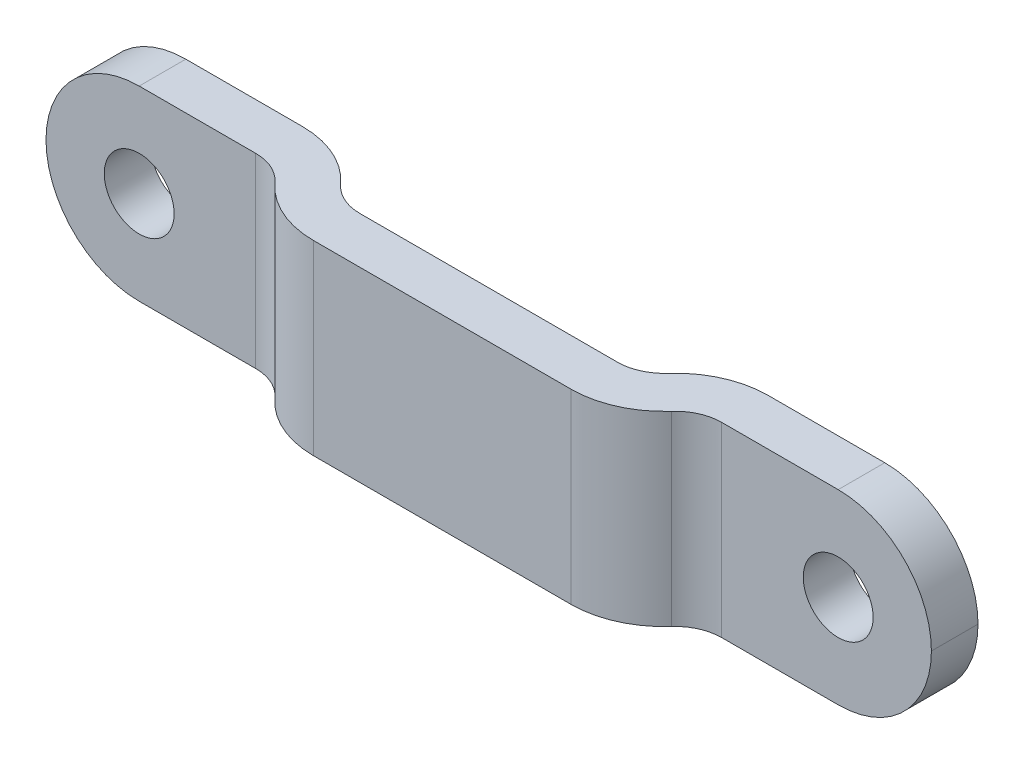
ISO-10303-21;
HEADER;
FILE_DESCRIPTION(('STEP AP214'),'2;1');
FILE_NAME('part.step','',(''),(''),'','','');
FILE_SCHEMA(('AUTOMOTIVE_DESIGN { 1 0 10303 214 1 1 1 1 }'));
ENDSEC;
DATA;
#1=APPLICATION_CONTEXT('core data for automotive mechanical design processes');
#2=APPLICATION_PROTOCOL_DEFINITION('international standard','automotive_design',2000,#1);
#3=PRODUCT_CONTEXT('',#1,'mechanical');
#4=PRODUCT('Part','Part','',(#3));
#5=PRODUCT_RELATED_PRODUCT_CATEGORY('part','',(#4));
#6=PRODUCT_DEFINITION_FORMATION('','',#4);
#7=PRODUCT_DEFINITION_CONTEXT('part definition',#1,'design');
#8=PRODUCT_DEFINITION('design','',#6,#7);
#9=PRODUCT_DEFINITION_SHAPE('','',#8);
#10=(LENGTH_UNIT() NAMED_UNIT(*) SI_UNIT(.MILLI.,.METRE.));
#11=(NAMED_UNIT(*) PLANE_ANGLE_UNIT() SI_UNIT($,.RADIAN.));
#12=(NAMED_UNIT(*) SI_UNIT($,.STERADIAN.) SOLID_ANGLE_UNIT());
#13=UNCERTAINTY_MEASURE_WITH_UNIT(LENGTH_MEASURE(1.E-05),#10,'distance_accuracy_value','');
#14=(GEOMETRIC_REPRESENTATION_CONTEXT(3) GLOBAL_UNCERTAINTY_ASSIGNED_CONTEXT((#13)) GLOBAL_UNIT_ASSIGNED_CONTEXT((#10,
#11,#12)) REPRESENTATION_CONTEXT('',''));
#15=CARTESIAN_POINT('',(0.,0.,0.));
#16=DIRECTION('',(0.,0.,1.));
#17=DIRECTION('',(1.,0.,0.));
#18=AXIS2_PLACEMENT_3D('',#15,#16,#17);
#19=CARTESIAN_POINT('',(-30.1625,6.35,3.175));
#20=DIRECTION('',(0.,0.,-1.));
#21=DIRECTION('',(-1.,0.,0.));
#22=AXIS2_PLACEMENT_3D('',#19,#20,#21);
#23=PLANE('',#22);
#24=CARTESIAN_POINT('',(-23.8125,0.,3.17500000000001));
#25=DIRECTION('',(0.,0.,1.));
#26=DIRECTION('',(1.,0.,0.));
#27=AXIS2_PLACEMENT_3D('',#24,#25,#26);
#28=CIRCLE('',#27,2.38125);
#29=CARTESIAN_POINT('',(-21.43125,0.,3.17500000000001));
#30=VERTEX_POINT('',#29);
#31=EDGE_CURVE('E320',#30,#30,#28,.T.);
#32=ORIENTED_EDGE('',*,*,#31,.F.);
#33=EDGE_LOOP('',(#32));
#34=FACE_BOUND('',#33,.T.);
#35=DIRECTION('',(1.,0.,0.));
#36=VECTOR('',#35,1.);
#37=CARTESIAN_POINT('',(-30.1625,6.35,3.175));
#38=LINE('',#37,#36);
#39=CARTESIAN_POINT('',(-23.8125,6.35,3.175));
#40=VERTEX_POINT('',#39);
#41=CARTESIAN_POINT('',(-15.875,6.35,3.17500000000001));
#42=VERTEX_POINT('',#41);
#43=EDGE_CURVE('E170',#40,#42,#38,.T.);
#44=ORIENTED_EDGE('',*,*,#43,.F.);
#45=CARTESIAN_POINT('',(-23.8125,0.,3.175));
#46=DIRECTION('',(0.,0.,-1.));
#47=DIRECTION('',(-1.,0.,0.));
#48=AXIS2_PLACEMENT_3D('',#45,#46,#47);
#49=CIRCLE('',#48,6.35);
#50=CARTESIAN_POINT('',(-30.1625,0.,3.175));
#51=VERTEX_POINT('',#50);
#52=EDGE_CURVE('E68',#40,#51,#49,.F.);
#53=ORIENTED_EDGE('',*,*,#52,.T.);
#54=CARTESIAN_POINT('',(-23.8125,0.,3.175));
#55=DIRECTION('',(0.,0.,-1.));
#56=DIRECTION('',(-1.,0.,0.));
#57=AXIS2_PLACEMENT_3D('',#54,#55,#56);
#58=CIRCLE('',#57,6.35);
#59=CARTESIAN_POINT('',(-23.8125,-6.35,3.175));
#60=VERTEX_POINT('',#59);
#61=EDGE_CURVE('E301',#51,#60,#58,.F.);
#62=ORIENTED_EDGE('',*,*,#61,.T.);
#63=DIRECTION('',(1.,0.,0.));
#64=VECTOR('',#63,1.);
#65=CARTESIAN_POINT('',(-30.1625,-6.35,3.175));
#66=LINE('',#65,#64);
#67=CARTESIAN_POINT('',(-15.875,-6.35,3.17500000000001));
#68=VERTEX_POINT('',#67);
#69=EDGE_CURVE('E185',#60,#68,#66,.T.);
#70=ORIENTED_EDGE('',*,*,#69,.T.);
#71=DIRECTION('',(0.,-1.,0.));
#72=VECTOR('',#71,1.);
#73=CARTESIAN_POINT('',(-15.875,6.35,3.17500000000001));
#74=LINE('',#73,#72);
#75=EDGE_CURVE('E183',#42,#68,#74,.T.);
#76=ORIENTED_EDGE('',*,*,#75,.F.);
#77=EDGE_LOOP('',(#44,#53,#62,#70,#76));
#78=FACE_BOUND('',#77,.T.);
#79=ADVANCED_FACE('F45',(#34,#78),#23,.F.);
#80=CARTESIAN_POINT('',(-15.875,6.35,6.35));
#81=DIRECTION('',(0.,-1.,0.));
#82=DIRECTION('',(0.,0.,-1.));
#83=AXIS2_PLACEMENT_3D('',#80,#81,#82);
#84=CYLINDRICAL_SURFACE('',#83,3.175);
#85=CARTESIAN_POINT('',(-15.875,-6.35,6.35));
#86=DIRECTION('',(0.,-1.,0.));
#87=DIRECTION('',(0.,0.,-1.));
#88=AXIS2_PLACEMENT_3D('',#85,#86,#87);
#89=CIRCLE('',#88,3.175);
#90=CARTESIAN_POINT('',(-13.5084947238127,-6.35,4.23333333333334));
#91=VERTEX_POINT('',#90);
#92=EDGE_CURVE('E228',#68,#91,#89,.T.);
#93=ORIENTED_EDGE('',*,*,#92,.T.);
#94=DIRECTION('',(0.,-1.,0.));
#95=VECTOR('',#94,1.);
#96=CARTESIAN_POINT('',(-13.5084947238127,6.35,4.23333333333334));
#97=LINE('',#96,#95);
#98=CARTESIAN_POINT('',(-13.5084947238127,6.35,4.23333333333334));
#99=VERTEX_POINT('',#98);
#100=EDGE_CURVE('E189',#99,#91,#97,.T.);
#101=ORIENTED_EDGE('',*,*,#100,.F.);
#102=CARTESIAN_POINT('',(-15.875,6.35,6.35));
#103=DIRECTION('',(0.,-1.,0.));
#104=DIRECTION('',(0.,0.,-1.));
#105=AXIS2_PLACEMENT_3D('',#102,#103,#104);
#106=CIRCLE('',#105,3.175);
#107=EDGE_CURVE('E175',#42,#99,#106,.T.);
#108=ORIENTED_EDGE('',*,*,#107,.F.);
#109=ORIENTED_EDGE('',*,*,#75,.T.);
#110=EDGE_LOOP('',(#93,#101,#108,#109));
#111=FACE_BOUND('',#110,.T.);
#112=ADVANCED_FACE('F191',(#111),#84,.F.);
#113=CARTESIAN_POINT('',(-8.77548417143817,6.35,0.));
#114=DIRECTION('',(0.,-1.,0.));
#115=DIRECTION('',(0.,0.,-1.));
#116=AXIS2_PLACEMENT_3D('',#113,#114,#115);
#117=CYLINDRICAL_SURFACE('',#116,6.35);
#118=CARTESIAN_POINT('',(-8.77548417143817,-6.35,0.));
#119=DIRECTION('',(0.,1.,0.));
#120=DIRECTION('',(0.,0.,1.));
#121=AXIS2_PLACEMENT_3D('',#118,#119,#120);
#122=CIRCLE('',#121,6.35);
#123=CARTESIAN_POINT('',(-8.77548417143817,-6.35,6.35));
#124=VERTEX_POINT('',#123);
#125=EDGE_CURVE('E231',#91,#124,#122,.T.);
#126=ORIENTED_EDGE('',*,*,#125,.T.);
#127=DIRECTION('',(0.,-1.,0.));
#128=VECTOR('',#127,1.);
#129=CARTESIAN_POINT('',(-8.77548417143817,6.35,6.35));
#130=LINE('',#129,#128);
#131=CARTESIAN_POINT('',(-8.77548417143817,6.35,6.35));
#132=VERTEX_POINT('',#131);
#133=EDGE_CURVE('E282',#132,#124,#130,.T.);
#134=ORIENTED_EDGE('',*,*,#133,.F.);
#135=CARTESIAN_POINT('',(-8.77548417143817,6.35,0.));
#136=DIRECTION('',(0.,1.,0.));
#137=DIRECTION('',(0.,0.,1.));
#138=AXIS2_PLACEMENT_3D('',#135,#136,#137);
#139=CIRCLE('',#138,6.35);
#140=EDGE_CURVE('E194',#99,#132,#139,.T.);
#141=ORIENTED_EDGE('',*,*,#140,.F.);
#142=ORIENTED_EDGE('',*,*,#100,.T.);
#143=EDGE_LOOP('',(#126,#134,#141,#142));
#144=FACE_BOUND('',#143,.T.);
#145=ADVANCED_FACE('F340',(#144),#117,.T.);
#146=CARTESIAN_POINT('',(-8.77548417143817,6.35,6.35));
#147=DIRECTION('',(0.,0.,-1.));
#148=DIRECTION('',(-1.,0.,0.));
#149=AXIS2_PLACEMENT_3D('',#146,#147,#148);
#150=PLANE('',#149);
#151=DIRECTION('',(1.,0.,0.));
#152=VECTOR('',#151,1.);
#153=CARTESIAN_POINT('',(-8.77548417143817,-6.35,6.35));
#154=LINE('',#153,#152);
#155=CARTESIAN_POINT('',(8.77548417143817,-6.35,6.35));
#156=VERTEX_POINT('',#155);
#157=EDGE_CURVE('E233',#124,#156,#154,.T.);
#158=ORIENTED_EDGE('',*,*,#157,.T.);
#159=DIRECTION('',(0.,-1.,0.));
#160=VECTOR('',#159,1.);
#161=CARTESIAN_POINT('',(8.77548417143817,6.35,6.35));
#162=LINE('',#161,#160);
#163=CARTESIAN_POINT('',(8.77548417143817,6.35,6.35));
#164=VERTEX_POINT('',#163);
#165=EDGE_CURVE('E280',#164,#156,#162,.T.);
#166=ORIENTED_EDGE('',*,*,#165,.F.);
#167=DIRECTION('',(1.,0.,0.));
#168=VECTOR('',#167,1.);
#169=CARTESIAN_POINT('',(-8.77548417143817,6.35,6.35));
#170=LINE('',#169,#168);
#171=EDGE_CURVE('E196',#132,#164,#170,.T.);
#172=ORIENTED_EDGE('',*,*,#171,.F.);
#173=ORIENTED_EDGE('',*,*,#133,.T.);
#174=EDGE_LOOP('',(#158,#166,#172,#173));
#175=FACE_BOUND('',#174,.T.);
#176=ADVANCED_FACE('F380',(#175),#150,.F.);
#177=CARTESIAN_POINT('',(8.77548417143817,6.35,0.));
#178=DIRECTION('',(0.,-1.,0.));
#179=DIRECTION('',(0.,0.,-1.));
#180=AXIS2_PLACEMENT_3D('',#177,#178,#179);
#181=CYLINDRICAL_SURFACE('',#180,6.35);
#182=CARTESIAN_POINT('',(8.77548417143817,-6.35,0.));
#183=DIRECTION('',(0.,-1.,0.));
#184=DIRECTION('',(0.,0.,-1.));
#185=AXIS2_PLACEMENT_3D('',#182,#183,#184);
#186=CIRCLE('',#185,6.35);
#187=CARTESIAN_POINT('',(13.5084947238127,-6.35,4.23333333333334));
#188=VERTEX_POINT('',#187);
#189=EDGE_CURVE('E236',#188,#156,#186,.T.);
#190=ORIENTED_EDGE('',*,*,#189,.F.);
#191=DIRECTION('',(0.,-1.,0.));
#192=VECTOR('',#191,1.);
#193=CARTESIAN_POINT('',(13.5084947238127,6.35,4.23333333333334));
#194=LINE('',#193,#192);
#195=CARTESIAN_POINT('',(13.5084947238127,6.35,4.23333333333334));
#196=VERTEX_POINT('',#195);
#197=EDGE_CURVE('E278',#196,#188,#194,.T.);
#198=ORIENTED_EDGE('',*,*,#197,.F.);
#199=CARTESIAN_POINT('',(8.77548417143817,6.35,0.));
#200=DIRECTION('',(0.,-1.,0.));
#201=DIRECTION('',(0.,0.,-1.));
#202=AXIS2_PLACEMENT_3D('',#199,#200,#201);
#203=CIRCLE('',#202,6.35);
#204=EDGE_CURVE('E201',#196,#164,#203,.T.);
#205=ORIENTED_EDGE('',*,*,#204,.T.);
#206=ORIENTED_EDGE('',*,*,#165,.T.);
#207=EDGE_LOOP('',(#190,#198,#205,#206));
#208=FACE_BOUND('',#207,.T.);
#209=ADVANCED_FACE('F383',(#208),#181,.T.);
#210=CARTESIAN_POINT('',(15.875,6.35,6.35));
#211=DIRECTION('',(0.,-1.,0.));
#212=DIRECTION('',(0.,0.,-1.));
#213=AXIS2_PLACEMENT_3D('',#210,#211,#212);
#214=CYLINDRICAL_SURFACE('',#213,3.17499999999999);
#215=CARTESIAN_POINT('',(15.875,-6.35,6.35));
#216=DIRECTION('',(0.,1.,0.));
#217=DIRECTION('',(0.,0.,1.));
#218=AXIS2_PLACEMENT_3D('',#215,#216,#217);
#219=CIRCLE('',#218,3.17499999999999);
#220=CARTESIAN_POINT('',(15.875,-6.35,3.175));
#221=VERTEX_POINT('',#220);
#222=EDGE_CURVE('E239',#221,#188,#219,.T.);
#223=ORIENTED_EDGE('',*,*,#222,.F.);
#224=DIRECTION('',(0.,-1.,0.));
#225=VECTOR('',#224,1.);
#226=CARTESIAN_POINT('',(15.875,6.35,3.175));
#227=LINE('',#226,#225);
#228=CARTESIAN_POINT('',(15.875,6.35,3.175));
#229=VERTEX_POINT('',#228);
#230=EDGE_CURVE('E275',#229,#221,#227,.T.);
#231=ORIENTED_EDGE('',*,*,#230,.F.);
#232=CARTESIAN_POINT('',(15.875,6.35,6.35));
#233=DIRECTION('',(0.,1.,0.));
#234=DIRECTION('',(0.,0.,1.));
#235=AXIS2_PLACEMENT_3D('',#232,#233,#234);
#236=CIRCLE('',#235,3.17499999999999);
#237=EDGE_CURVE('E204',#229,#196,#236,.T.);
#238=ORIENTED_EDGE('',*,*,#237,.T.);
#239=ORIENTED_EDGE('',*,*,#197,.T.);
#240=EDGE_LOOP('',(#223,#231,#238,#239));
#241=FACE_BOUND('',#240,.T.);
#242=ADVANCED_FACE('F386',(#241),#214,.F.);
#243=CARTESIAN_POINT('',(30.1625,6.35,3.175));
#244=DIRECTION('',(0.,0.,1.));
#245=DIRECTION('',(1.,0.,0.));
#246=AXIS2_PLACEMENT_3D('',#243,#244,#245);
#247=PLANE('',#246);
#248=CARTESIAN_POINT('',(23.8125,0.,3.17500000000001));
#249=DIRECTION('',(0.,0.,1.));
#250=DIRECTION('',(1.,0.,0.));
#251=AXIS2_PLACEMENT_3D('',#248,#249,#250);
#252=CIRCLE('',#251,2.38125);
#253=CARTESIAN_POINT('',(26.19375,0.,3.17500000000001));
#254=VERTEX_POINT('',#253);
#255=EDGE_CURVE('E313',#254,#254,#252,.T.);
#256=ORIENTED_EDGE('',*,*,#255,.F.);
#257=EDGE_LOOP('',(#256));
#258=FACE_BOUND('',#257,.T.);
#259=CARTESIAN_POINT('',(23.8125,0.,3.175));
#260=DIRECTION('',(0.,0.,1.));
#261=DIRECTION('',(1.,0.,0.));
#262=AXIS2_PLACEMENT_3D('',#259,#260,#261);
#263=CIRCLE('',#262,6.35);
#264=CARTESIAN_POINT('',(23.8125,-6.35,3.175));
#265=VERTEX_POINT('',#264);
#266=CARTESIAN_POINT('',(30.1625,0.,3.175));
#267=VERTEX_POINT('',#266);
#268=EDGE_CURVE('E188',#265,#267,#263,.T.);
#269=ORIENTED_EDGE('',*,*,#268,.T.);
#270=CARTESIAN_POINT('',(23.8125,0.,3.175));
#271=DIRECTION('',(0.,0.,1.));
#272=DIRECTION('',(1.,0.,0.));
#273=AXIS2_PLACEMENT_3D('',#270,#271,#272);
#274=CIRCLE('',#273,6.35);
#275=CARTESIAN_POINT('',(23.8125,6.35,3.175));
#276=VERTEX_POINT('',#275);
#277=EDGE_CURVE('E287',#267,#276,#274,.T.);
#278=ORIENTED_EDGE('',*,*,#277,.T.);
#279=DIRECTION('',(-1.,0.,0.));
#280=VECTOR('',#279,1.);
#281=CARTESIAN_POINT('',(30.1625,6.35,3.175));
#282=LINE('',#281,#280);
#283=EDGE_CURVE('E207',#276,#229,#282,.T.);
#284=ORIENTED_EDGE('',*,*,#283,.T.);
#285=ORIENTED_EDGE('',*,*,#230,.T.);
#286=DIRECTION('',(-1.,0.,0.));
#287=VECTOR('',#286,1.);
#288=CARTESIAN_POINT('',(30.1625,-6.35,3.175));
#289=LINE('',#288,#287);
#290=EDGE_CURVE('E242',#265,#221,#289,.T.);
#291=ORIENTED_EDGE('',*,*,#290,.F.);
#292=EDGE_LOOP('',(#269,#278,#284,#285,#291));
#293=FACE_BOUND('',#292,.T.);
#294=ADVANCED_FACE('F399',(#258,#293),#247,.T.);
#295=CARTESIAN_POINT('',(30.1625,6.35,0.));
#296=DIRECTION('',(0.,0.,1.));
#297=DIRECTION('',(1.,0.,0.));
#298=AXIS2_PLACEMENT_3D('',#295,#296,#297);
#299=PLANE('',#298);
#300=CARTESIAN_POINT('',(23.8125,0.,0.));
#301=DIRECTION('',(0.,0.,1.));
#302=DIRECTION('',(1.,0.,0.));
#303=AXIS2_PLACEMENT_3D('',#300,#301,#302);
#304=CIRCLE('',#303,2.38125);
#305=CARTESIAN_POINT('',(26.19375,0.,0.));
#306=VERTEX_POINT('',#305);
#307=EDGE_CURVE('E309',#306,#306,#304,.T.);
#308=ORIENTED_EDGE('',*,*,#307,.T.);
#309=EDGE_LOOP('',(#308));
#310=FACE_BOUND('',#309,.T.);
#311=DIRECTION('',(-1.,0.,0.));
#312=VECTOR('',#311,1.);
#313=CARTESIAN_POINT('',(30.1625,6.35,0.));
#314=LINE('',#313,#312);
#315=CARTESIAN_POINT('',(23.8125,6.35,0.));
#316=VERTEX_POINT('',#315);
#317=CARTESIAN_POINT('',(15.875,6.35,0.));
#318=VERTEX_POINT('',#317);
#319=EDGE_CURVE('E209',#316,#318,#314,.T.);
#320=ORIENTED_EDGE('',*,*,#319,.F.);
#321=CARTESIAN_POINT('',(23.8125,0.,0.));
#322=DIRECTION('',(0.,0.,1.));
#323=DIRECTION('',(1.,0.,0.));
#324=AXIS2_PLACEMENT_3D('',#321,#322,#323);
#325=CIRCLE('',#324,6.35);
#326=CARTESIAN_POINT('',(30.1625,0.,0.));
#327=VERTEX_POINT('',#326);
#328=EDGE_CURVE('E295',#316,#327,#325,.F.);
#329=ORIENTED_EDGE('',*,*,#328,.T.);
#330=CARTESIAN_POINT('',(23.8125,0.,0.));
#331=DIRECTION('',(0.,0.,1.));
#332=DIRECTION('',(1.,0.,0.));
#333=AXIS2_PLACEMENT_3D('',#330,#331,#332);
#334=CIRCLE('',#333,6.35);
#335=CARTESIAN_POINT('',(23.8125,-6.35,0.));
#336=VERTEX_POINT('',#335);
#337=EDGE_CURVE('E293',#327,#336,#334,.F.);
#338=ORIENTED_EDGE('',*,*,#337,.T.);
#339=DIRECTION('',(-1.,0.,0.));
#340=VECTOR('',#339,1.);
#341=CARTESIAN_POINT('',(30.1625,-6.35,0.));
#342=LINE('',#341,#340);
#343=CARTESIAN_POINT('',(15.875,-6.35,0.));
#344=VERTEX_POINT('',#343);
#345=EDGE_CURVE('E244',#336,#344,#342,.T.);
#346=ORIENTED_EDGE('',*,*,#345,.T.);
#347=DIRECTION('',(0.,-1.,0.));
#348=VECTOR('',#347,1.);
#349=CARTESIAN_POINT('',(15.875,6.35,0.));
#350=LINE('',#349,#348);
#351=EDGE_CURVE('E272',#318,#344,#350,.T.);
#352=ORIENTED_EDGE('',*,*,#351,.F.);
#353=EDGE_LOOP('',(#320,#329,#338,#346,#352));
#354=FACE_BOUND('',#353,.T.);
#355=ADVANCED_FACE('F393',(#310,#354),#299,.F.);
#356=CARTESIAN_POINT('',(15.875,6.35,6.35));
#357=DIRECTION('',(0.,-1.,0.));
#358=DIRECTION('',(0.,0.,-1.));
#359=AXIS2_PLACEMENT_3D('',#356,#357,#358);
#360=CYLINDRICAL_SURFACE('',#359,6.35);
#361=CARTESIAN_POINT('',(15.875,-6.35,6.35));
#362=DIRECTION('',(0.,1.,0.));
#363=DIRECTION('',(0.,0.,1.));
#364=AXIS2_PLACEMENT_3D('',#361,#362,#363);
#365=CIRCLE('',#364,6.35);
#366=CARTESIAN_POINT('',(11.1419894476254,-6.35,2.11666666666667));
#367=VERTEX_POINT('',#366);
#368=EDGE_CURVE('E246',#344,#367,#365,.T.);
#369=ORIENTED_EDGE('',*,*,#368,.T.);
#370=DIRECTION('',(0.,-1.,0.));
#371=VECTOR('',#370,1.);
#372=CARTESIAN_POINT('',(11.1419894476254,6.35,2.11666666666667));
#373=LINE('',#372,#371);
#374=CARTESIAN_POINT('',(11.1419894476254,6.35,2.11666666666667));
#375=VERTEX_POINT('',#374);
#376=EDGE_CURVE('E269',#375,#367,#373,.T.);
#377=ORIENTED_EDGE('',*,*,#376,.F.);
#378=CARTESIAN_POINT('',(15.875,6.35,6.35));
#379=DIRECTION('',(0.,1.,0.));
#380=DIRECTION('',(0.,0.,1.));
#381=AXIS2_PLACEMENT_3D('',#378,#379,#380);
#382=CIRCLE('',#381,6.35);
#383=EDGE_CURVE('E211',#318,#375,#382,.T.);
#384=ORIENTED_EDGE('',*,*,#383,.F.);
#385=ORIENTED_EDGE('',*,*,#351,.T.);
#386=EDGE_LOOP('',(#369,#377,#384,#385));
#387=FACE_BOUND('',#386,.T.);
#388=ADVANCED_FACE('F407',(#387),#360,.T.);
#389=CARTESIAN_POINT('',(8.77548417143817,6.35,0.));
#390=DIRECTION('',(0.,-1.,0.));
#391=DIRECTION('',(0.,0.,-1.));
#392=AXIS2_PLACEMENT_3D('',#389,#390,#391);
#393=CYLINDRICAL_SURFACE('',#392,3.17499999999999);
#394=CARTESIAN_POINT('',(8.77548417143817,-6.35,0.));
#395=DIRECTION('',(0.,-1.,0.));
#396=DIRECTION('',(0.,0.,-1.));
#397=AXIS2_PLACEMENT_3D('',#394,#395,#396);
#398=CIRCLE('',#397,3.17499999999999);
#399=CARTESIAN_POINT('',(8.77548417143817,-6.35,3.175));
#400=VERTEX_POINT('',#399);
#401=EDGE_CURVE('E248',#367,#400,#398,.T.);
#402=ORIENTED_EDGE('',*,*,#401,.T.);
#403=DIRECTION('',(0.,-1.,0.));
#404=VECTOR('',#403,1.);
#405=CARTESIAN_POINT('',(8.77548417143817,6.35,3.175));
#406=LINE('',#405,#404);
#407=CARTESIAN_POINT('',(8.77548417143817,6.35,3.175));
#408=VERTEX_POINT('',#407);
#409=EDGE_CURVE('E267',#408,#400,#406,.T.);
#410=ORIENTED_EDGE('',*,*,#409,.F.);
#411=CARTESIAN_POINT('',(8.77548417143817,6.35,0.));
#412=DIRECTION('',(0.,-1.,0.));
#413=DIRECTION('',(0.,0.,-1.));
#414=AXIS2_PLACEMENT_3D('',#411,#412,#413);
#415=CIRCLE('',#414,3.17499999999999);
#416=EDGE_CURVE('E213',#375,#408,#415,.T.);
#417=ORIENTED_EDGE('',*,*,#416,.F.);
#418=ORIENTED_EDGE('',*,*,#376,.T.);
#419=EDGE_LOOP('',(#402,#410,#417,#418));
#420=FACE_BOUND('',#419,.T.);
#421=ADVANCED_FACE('F455',(#420),#393,.F.);
#422=CARTESIAN_POINT('',(-8.77548417143817,6.35,3.175));
#423=DIRECTION('',(0.,0.,-1.));
#424=DIRECTION('',(-1.,0.,0.));
#425=AXIS2_PLACEMENT_3D('',#422,#423,#424);
#426=PLANE('',#425);
#427=DIRECTION('',(1.,0.,0.));
#428=VECTOR('',#427,1.);
#429=CARTESIAN_POINT('',(-8.77548417143817,-6.35,3.175));
#430=LINE('',#429,#428);
#431=CARTESIAN_POINT('',(-8.77548417143817,-6.35,3.175));
#432=VERTEX_POINT('',#431);
#433=EDGE_CURVE('E251',#432,#400,#430,.T.);
#434=ORIENTED_EDGE('',*,*,#433,.F.);
#435=DIRECTION('',(0.,-1.,0.));
#436=VECTOR('',#435,1.);
#437=CARTESIAN_POINT('',(-8.77548417143817,6.35,3.175));
#438=LINE('',#437,#436);
#439=CARTESIAN_POINT('',(-8.77548417143817,6.35,3.175));
#440=VERTEX_POINT('',#439);
#441=EDGE_CURVE('E265',#440,#432,#438,.T.);
#442=ORIENTED_EDGE('',*,*,#441,.F.);
#443=DIRECTION('',(1.,0.,0.));
#444=VECTOR('',#443,1.);
#445=CARTESIAN_POINT('',(-8.77548417143817,6.35,3.175));
#446=LINE('',#445,#444);
#447=EDGE_CURVE('E215',#440,#408,#446,.T.);
#448=ORIENTED_EDGE('',*,*,#447,.T.);
#449=ORIENTED_EDGE('',*,*,#409,.T.);
#450=EDGE_LOOP('',(#434,#442,#448,#449));
#451=FACE_BOUND('',#450,.T.);
#452=ADVANCED_FACE('F464',(#451),#426,.T.);
#453=CARTESIAN_POINT('',(-8.77548417143817,6.35,0.));
#454=DIRECTION('',(0.,-1.,0.));
#455=DIRECTION('',(0.,0.,-1.));
#456=AXIS2_PLACEMENT_3D('',#453,#454,#455);
#457=CYLINDRICAL_SURFACE('',#456,3.17499999999999);
#458=CARTESIAN_POINT('',(-8.77548417143817,-6.35,0.));
#459=DIRECTION('',(0.,1.,0.));
#460=DIRECTION('',(0.,0.,1.));
#461=AXIS2_PLACEMENT_3D('',#458,#459,#460);
#462=CIRCLE('',#461,3.17499999999999);
#463=CARTESIAN_POINT('',(-11.1419894476254,-6.35,2.11666666666667));
#464=VERTEX_POINT('',#463);
#465=EDGE_CURVE('E254',#464,#432,#462,.T.);
#466=ORIENTED_EDGE('',*,*,#465,.F.);
#467=DIRECTION('',(0.,-1.,0.));
#468=VECTOR('',#467,1.);
#469=CARTESIAN_POINT('',(-11.1419894476254,6.35,2.11666666666667));
#470=LINE('',#469,#468);
#471=CARTESIAN_POINT('',(-11.1419894476254,6.35,2.11666666666667));
#472=VERTEX_POINT('',#471);
#473=EDGE_CURVE('E263',#472,#464,#470,.T.);
#474=ORIENTED_EDGE('',*,*,#473,.F.);
#475=CARTESIAN_POINT('',(-8.77548417143817,6.35,0.));
#476=DIRECTION('',(0.,1.,0.));
#477=DIRECTION('',(0.,0.,1.));
#478=AXIS2_PLACEMENT_3D('',#475,#476,#477);
#479=CIRCLE('',#478,3.17499999999999);
#480=EDGE_CURVE('E218',#472,#440,#479,.T.);
#481=ORIENTED_EDGE('',*,*,#480,.T.);
#482=ORIENTED_EDGE('',*,*,#441,.T.);
#483=EDGE_LOOP('',(#466,#474,#481,#482));
#484=FACE_BOUND('',#483,.T.);
#485=ADVANCED_FACE('F474',(#484),#457,.F.);
#486=CARTESIAN_POINT('',(-15.875,6.35,6.35));
#487=DIRECTION('',(0.,-1.,0.));
#488=DIRECTION('',(0.,0.,-1.));
#489=AXIS2_PLACEMENT_3D('',#486,#487,#488);
#490=CYLINDRICAL_SURFACE('',#489,6.35);
#491=CARTESIAN_POINT('',(-15.875,-6.35,6.35));
#492=DIRECTION('',(0.,-1.,0.));
#493=DIRECTION('',(0.,0.,-1.));
#494=AXIS2_PLACEMENT_3D('',#491,#492,#493);
#495=CIRCLE('',#494,6.35);
#496=CARTESIAN_POINT('',(-15.875,-6.35,0.));
#497=VERTEX_POINT('',#496);
#498=EDGE_CURVE('E257',#497,#464,#495,.T.);
#499=ORIENTED_EDGE('',*,*,#498,.F.);
#500=DIRECTION('',(0.,-1.,0.));
#501=VECTOR('',#500,1.);
#502=CARTESIAN_POINT('',(-15.875,6.35,0.));
#503=LINE('',#502,#501);
#504=CARTESIAN_POINT('',(-15.875,6.35,0.));
#505=VERTEX_POINT('',#504);
#506=EDGE_CURVE('E226',#505,#497,#503,.T.);
#507=ORIENTED_EDGE('',*,*,#506,.F.);
#508=CARTESIAN_POINT('',(-15.875,6.35,6.35));
#509=DIRECTION('',(0.,-1.,0.));
#510=DIRECTION('',(0.,0.,-1.));
#511=AXIS2_PLACEMENT_3D('',#508,#509,#510);
#512=CIRCLE('',#511,6.35);
#513=EDGE_CURVE('E221',#505,#472,#512,.T.);
#514=ORIENTED_EDGE('',*,*,#513,.T.);
#515=ORIENTED_EDGE('',*,*,#473,.T.);
#516=EDGE_LOOP('',(#499,#507,#514,#515));
#517=FACE_BOUND('',#516,.T.);
#518=ADVANCED_FACE('F366',(#517),#490,.T.);
#519=CARTESIAN_POINT('',(-30.1625,6.35,0.));
#520=DIRECTION('',(0.,0.,-1.));
#521=DIRECTION('',(-1.,0.,0.));
#522=AXIS2_PLACEMENT_3D('',#519,#520,#521);
#523=PLANE('',#522);
#524=CARTESIAN_POINT('',(-23.8125,0.,0.));
#525=DIRECTION('',(0.,0.,1.));
#526=DIRECTION('',(1.,0.,0.));
#527=AXIS2_PLACEMENT_3D('',#524,#525,#526);
#528=CIRCLE('',#527,2.38125);
#529=CARTESIAN_POINT('',(-21.43125,0.,0.));
#530=VERTEX_POINT('',#529);
#531=EDGE_CURVE('E318',#530,#530,#528,.T.);
#532=ORIENTED_EDGE('',*,*,#531,.T.);
#533=EDGE_LOOP('',(#532));
#534=FACE_BOUND('',#533,.T.);
#535=CARTESIAN_POINT('',(-23.8125,0.,0.));
#536=DIRECTION('',(0.,0.,-1.));
#537=DIRECTION('',(-1.,0.,0.));
#538=AXIS2_PLACEMENT_3D('',#535,#536,#537);
#539=CIRCLE('',#538,6.35);
#540=CARTESIAN_POINT('',(-23.8125,-6.35,0.));
#541=VERTEX_POINT('',#540);
#542=CARTESIAN_POINT('',(-30.1625,0.,0.));
#543=VERTEX_POINT('',#542);
#544=EDGE_CURVE('E54',#541,#543,#539,.T.);
#545=ORIENTED_EDGE('',*,*,#544,.T.);
#546=CARTESIAN_POINT('',(-23.8125,0.,0.));
#547=DIRECTION('',(0.,0.,-1.));
#548=DIRECTION('',(-1.,0.,0.));
#549=AXIS2_PLACEMENT_3D('',#546,#547,#548);
#550=CIRCLE('',#549,6.35);
#551=CARTESIAN_POINT('',(-23.8125,6.35,0.));
#552=VERTEX_POINT('',#551);
#553=EDGE_CURVE('E11',#543,#552,#550,.T.);
#554=ORIENTED_EDGE('',*,*,#553,.T.);
#555=DIRECTION('',(1.,0.,0.));
#556=VECTOR('',#555,1.);
#557=CARTESIAN_POINT('',(-30.1625,6.35,0.));
#558=LINE('',#557,#556);
#559=EDGE_CURVE('E224',#552,#505,#558,.T.);
#560=ORIENTED_EDGE('',*,*,#559,.T.);
#561=ORIENTED_EDGE('',*,*,#506,.T.);
#562=DIRECTION('',(1.,0.,0.));
#563=VECTOR('',#562,1.);
#564=CARTESIAN_POINT('',(-30.1625,-6.35,0.));
#565=LINE('',#564,#563);
#566=EDGE_CURVE('E180',#541,#497,#565,.T.);
#567=ORIENTED_EDGE('',*,*,#566,.F.);
#568=EDGE_LOOP('',(#545,#554,#560,#561,#567));
#569=FACE_BOUND('',#568,.T.);
#570=ADVANCED_FACE('F326',(#534,#569),#523,.T.);
#571=CARTESIAN_POINT('',(-15.875,6.35,6.35));
#572=DIRECTION('',(0.,-1.,0.));
#573=DIRECTION('',(0.,0.,-1.));
#574=AXIS2_PLACEMENT_3D('',#571,#572,#573);
#575=PLANE('',#574);
#576=ORIENTED_EDGE('',*,*,#283,.F.);
#577=DIRECTION('',(0.,0.,1.));
#578=VECTOR('',#577,1.);
#579=CARTESIAN_POINT('',(23.8125,6.35,0.));
#580=LINE('',#579,#578);
#581=EDGE_CURVE('E290',#276,#316,#580,.F.);
#582=ORIENTED_EDGE('',*,*,#581,.T.);
#583=ORIENTED_EDGE('',*,*,#319,.T.);
#584=ORIENTED_EDGE('',*,*,#383,.T.);
#585=ORIENTED_EDGE('',*,*,#416,.T.);
#586=ORIENTED_EDGE('',*,*,#447,.F.);
#587=ORIENTED_EDGE('',*,*,#480,.F.);
#588=ORIENTED_EDGE('',*,*,#513,.F.);
#589=ORIENTED_EDGE('',*,*,#559,.F.);
#590=DIRECTION('',(0.,0.,1.));
#591=VECTOR('',#590,1.);
#592=CARTESIAN_POINT('',(-23.8125,6.35,6.35));
#593=LINE('',#592,#591);
#594=EDGE_CURVE('E179',#552,#40,#593,.T.);
#595=ORIENTED_EDGE('',*,*,#594,.T.);
#596=ORIENTED_EDGE('',*,*,#43,.T.);
#597=ORIENTED_EDGE('',*,*,#107,.T.);
#598=ORIENTED_EDGE('',*,*,#140,.T.);
#599=ORIENTED_EDGE('',*,*,#171,.T.);
#600=ORIENTED_EDGE('',*,*,#204,.F.);
#601=ORIENTED_EDGE('',*,*,#237,.F.);
#602=EDGE_LOOP('',(#576,#582,#583,#584,#585,#586,#587,#588,#589,#595,#596,#597,#598,#599,#600,#601));
#603=FACE_BOUND('',#602,.T.);
#604=ADVANCED_FACE('F173',(#603),#575,.F.);
#605=CARTESIAN_POINT('',(-15.875,-6.35,6.35));
#606=DIRECTION('',(0.,-1.,0.));
#607=DIRECTION('',(0.,0.,-1.));
#608=AXIS2_PLACEMENT_3D('',#605,#606,#607);
#609=PLANE('',#608);
#610=ORIENTED_EDGE('',*,*,#345,.F.);
#611=DIRECTION('',(0.,0.,1.));
#612=VECTOR('',#611,1.);
#613=CARTESIAN_POINT('',(23.8125,-6.35,6.35));
#614=LINE('',#613,#612);
#615=EDGE_CURVE('E299',#336,#265,#614,.T.);
#616=ORIENTED_EDGE('',*,*,#615,.T.);
#617=ORIENTED_EDGE('',*,*,#290,.T.);
#618=ORIENTED_EDGE('',*,*,#222,.T.);
#619=ORIENTED_EDGE('',*,*,#189,.T.);
#620=ORIENTED_EDGE('',*,*,#157,.F.);
#621=ORIENTED_EDGE('',*,*,#125,.F.);
#622=ORIENTED_EDGE('',*,*,#92,.F.);
#623=ORIENTED_EDGE('',*,*,#69,.F.);
#624=DIRECTION('',(0.,0.,1.));
#625=VECTOR('',#624,1.);
#626=CARTESIAN_POINT('',(-23.8125,-6.35,0.));
#627=LINE('',#626,#625);
#628=EDGE_CURVE('E297',#60,#541,#627,.F.);
#629=ORIENTED_EDGE('',*,*,#628,.T.);
#630=ORIENTED_EDGE('',*,*,#566,.T.);
#631=ORIENTED_EDGE('',*,*,#498,.T.);
#632=ORIENTED_EDGE('',*,*,#465,.T.);
#633=ORIENTED_EDGE('',*,*,#433,.T.);
#634=ORIENTED_EDGE('',*,*,#401,.F.);
#635=ORIENTED_EDGE('',*,*,#368,.F.);
#636=EDGE_LOOP('',(#610,#616,#617,#618,#619,#620,#621,#622,#623,#629,#630,#631,#632,#633,#634,#635));
#637=FACE_BOUND('',#636,.T.);
#638=ADVANCED_FACE('F349',(#637),#609,.T.);
#639=CARTESIAN_POINT('',(23.8125,0.,6.35));
#640=DIRECTION('',(0.,0.,1.));
#641=DIRECTION('',(1.,0.,0.));
#642=AXIS2_PLACEMENT_3D('',#639,#640,#641);
#643=CYLINDRICAL_SURFACE('',#642,6.35);
#644=ORIENTED_EDGE('',*,*,#615,.F.);
#645=ORIENTED_EDGE('',*,*,#337,.F.);
#646=DIRECTION('',(0.,0.,1.));
#647=VECTOR('',#646,1.);
#648=CARTESIAN_POINT('',(30.1625,0.,0.));
#649=LINE('',#648,#647);
#650=EDGE_CURVE('E229',#267,#327,#649,.F.);
#651=ORIENTED_EDGE('',*,*,#650,.F.);
#652=ORIENTED_EDGE('',*,*,#268,.F.);
#653=EDGE_LOOP('',(#644,#645,#651,#652));
#654=FACE_BOUND('',#653,.T.);
#655=ADVANCED_FACE('F347',(#654),#643,.T.);
#656=CARTESIAN_POINT('',(23.8125,0.,0.));
#657=DIRECTION('',(0.,0.,-1.));
#658=DIRECTION('',(-1.,0.,0.));
#659=AXIS2_PLACEMENT_3D('',#656,#657,#658);
#660=CYLINDRICAL_SURFACE('',#659,6.35);
#661=ORIENTED_EDGE('',*,*,#328,.F.);
#662=ORIENTED_EDGE('',*,*,#581,.F.);
#663=ORIENTED_EDGE('',*,*,#277,.F.);
#664=ORIENTED_EDGE('',*,*,#650,.T.);
#665=EDGE_LOOP('',(#661,#662,#663,#664));
#666=FACE_BOUND('',#665,.T.);
#667=ADVANCED_FACE('F344',(#666),#660,.T.);
#668=CARTESIAN_POINT('',(-23.8125,0.,0.));
#669=DIRECTION('',(0.,0.,-1.));
#670=DIRECTION('',(-1.,0.,0.));
#671=AXIS2_PLACEMENT_3D('',#668,#669,#670);
#672=CYLINDRICAL_SURFACE('',#671,6.35);
#673=DIRECTION('',(0.,0.,1.));
#674=VECTOR('',#673,1.);
#675=CARTESIAN_POINT('',(-30.1625,0.,3.175));
#676=LINE('',#675,#674);
#677=EDGE_CURVE('E49',#543,#51,#676,.T.);
#678=ORIENTED_EDGE('',*,*,#677,.F.);
#679=ORIENTED_EDGE('',*,*,#544,.F.);
#680=ORIENTED_EDGE('',*,*,#628,.F.);
#681=ORIENTED_EDGE('',*,*,#61,.F.);
#682=EDGE_LOOP('',(#678,#679,#680,#681));
#683=FACE_BOUND('',#682,.T.);
#684=ADVANCED_FACE('F47',(#683),#672,.T.);
#685=CARTESIAN_POINT('',(-23.8125,0.,6.35));
#686=DIRECTION('',(0.,0.,1.));
#687=DIRECTION('',(1.,0.,0.));
#688=AXIS2_PLACEMENT_3D('',#685,#686,#687);
#689=CYLINDRICAL_SURFACE('',#688,6.35);
#690=ORIENTED_EDGE('',*,*,#553,.F.);
#691=ORIENTED_EDGE('',*,*,#677,.T.);
#692=ORIENTED_EDGE('',*,*,#52,.F.);
#693=ORIENTED_EDGE('',*,*,#594,.F.);
#694=EDGE_LOOP('',(#690,#691,#692,#693));
#695=FACE_BOUND('',#694,.T.);
#696=ADVANCED_FACE('F351',(#695),#689,.T.);
#697=CARTESIAN_POINT('',(23.8125,0.,0.));
#698=DIRECTION('',(0.,0.,1.));
#699=DIRECTION('',(1.,0.,0.));
#700=AXIS2_PLACEMENT_3D('',#697,#698,#699);
#701=CYLINDRICAL_SURFACE('',#700,2.38125);
#702=ORIENTED_EDGE('',*,*,#307,.F.);
#703=EDGE_LOOP('',(#702));
#704=FACE_BOUND('',#703,.T.);
#705=ORIENTED_EDGE('',*,*,#255,.T.);
#706=EDGE_LOOP('',(#705));
#707=FACE_BOUND('',#706,.T.);
#708=ADVANCED_FACE('F331',(#704,#707),#701,.F.);
#709=CARTESIAN_POINT('',(-23.8125,0.,0.));
#710=DIRECTION('',(0.,0.,1.));
#711=DIRECTION('',(1.,0.,0.));
#712=AXIS2_PLACEMENT_3D('',#709,#710,#711);
#713=CYLINDRICAL_SURFACE('',#712,2.38125);
#714=ORIENTED_EDGE('',*,*,#531,.F.);
#715=EDGE_LOOP('',(#714));
#716=FACE_BOUND('',#715,.T.);
#717=ORIENTED_EDGE('',*,*,#31,.T.);
#718=EDGE_LOOP('',(#717));
#719=FACE_BOUND('',#718,.T.);
#720=ADVANCED_FACE('F328',(#716,#719),#713,.F.);
#721=CLOSED_SHELL('',(#79,#112,#145,#176,#209,#242,#294,#355,#388,#421,#452,#485,#518,#570,#604,
#638,#655,#667,#684,#696,#708,#720));
#722=MANIFOLD_SOLID_BREP('B2',#721);
#723=ADVANCED_BREP_SHAPE_REPRESENTATION('',(#18,#722),#14);
#724=SHAPE_DEFINITION_REPRESENTATION(#9,#723);
ENDSEC;
END-ISO-10303-21;
